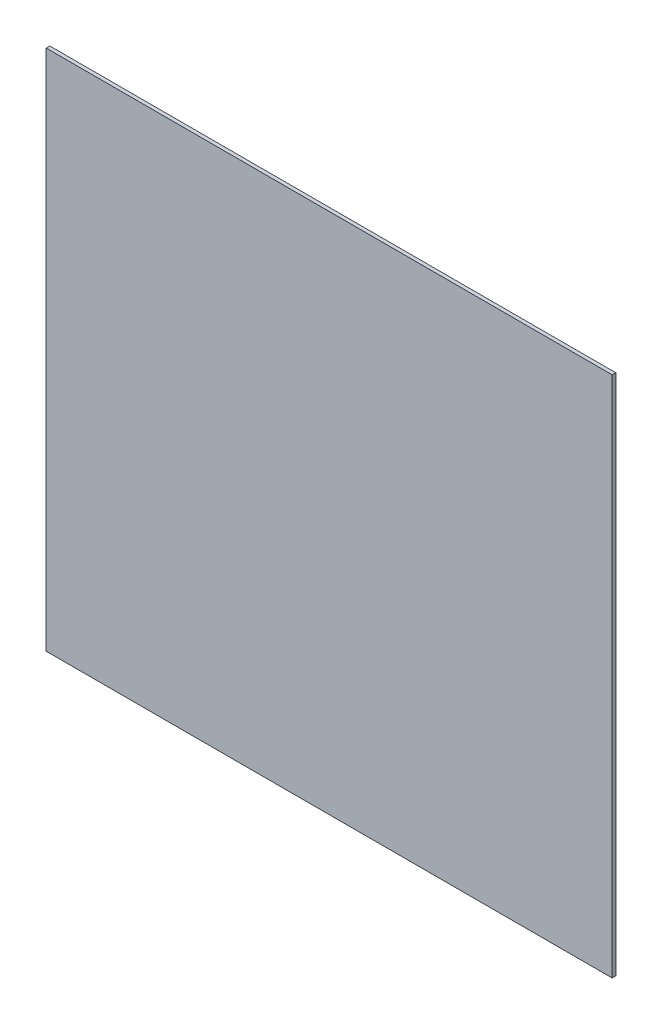
ISO-10303-21;
HEADER;
FILE_DESCRIPTION(('STEP AP214'),'2;1');
FILE_NAME('part.step','',(''),(''),'','','');
FILE_SCHEMA(('AUTOMOTIVE_DESIGN { 1 0 10303 214 1 1 1 1 }'));
ENDSEC;
DATA;
#1=APPLICATION_CONTEXT('core data for automotive mechanical design processes');
#2=APPLICATION_PROTOCOL_DEFINITION('international standard','automotive_design',2000,#1);
#3=PRODUCT_CONTEXT('',#1,'mechanical');
#4=PRODUCT('Part','Part','',(#3));
#5=PRODUCT_RELATED_PRODUCT_CATEGORY('part','',(#4));
#6=PRODUCT_DEFINITION_FORMATION('','',#4);
#7=PRODUCT_DEFINITION_CONTEXT('part definition',#1,'design');
#8=PRODUCT_DEFINITION('design','',#6,#7);
#9=PRODUCT_DEFINITION_SHAPE('','',#8);
#10=(LENGTH_UNIT() NAMED_UNIT(*) SI_UNIT(.MILLI.,.METRE.));
#11=(NAMED_UNIT(*) PLANE_ANGLE_UNIT() SI_UNIT($,.RADIAN.));
#12=(NAMED_UNIT(*) SI_UNIT($,.STERADIAN.) SOLID_ANGLE_UNIT());
#13=UNCERTAINTY_MEASURE_WITH_UNIT(LENGTH_MEASURE(1.E-05),#10,'distance_accuracy_value','');
#14=(GEOMETRIC_REPRESENTATION_CONTEXT(3) GLOBAL_UNCERTAINTY_ASSIGNED_CONTEXT((#13)) GLOBAL_UNIT_ASSIGNED_CONTEXT((#10,
#11,#12)) REPRESENTATION_CONTEXT('',''));
#15=CARTESIAN_POINT('',(0.,0.,0.));
#16=DIRECTION('',(0.,0.,1.));
#17=DIRECTION('',(1.,0.,0.));
#18=AXIS2_PLACEMENT_3D('',#15,#16,#17);
#19=CARTESIAN_POINT('',(456.,312.49200439453,0.41148));
#20=DIRECTION('',(0.,0.,1.));
#21=DIRECTION('',(1.,0.,0.));
#22=AXIS2_PLACEMENT_3D('',#19,#20,#21);
#23=PLANE('',#22);
#24=DIRECTION('',(1.,0.,0.));
#25=VECTOR('',#24,1.);
#26=CARTESIAN_POINT('',(456.,313.,0.41148));
#27=LINE('',#26,#25);
#28=CARTESIAN_POINT('',(456.,313.,0.41148));
#29=VERTEX_POINT('',#28);
#30=CARTESIAN_POINT('',(521.,313.,0.41148));
#31=VERTEX_POINT('',#30);
#32=EDGE_CURVE('E70',#29,#31,#27,.T.);
#33=ORIENTED_EDGE('',*,*,#32,.F.);
#34=DIRECTION('',(0.,1.,0.));
#35=VECTOR('',#34,1.);
#36=CARTESIAN_POINT('',(456.,253.,0.41148));
#37=LINE('',#36,#35);
#38=CARTESIAN_POINT('',(456.,253.,0.41148));
#39=VERTEX_POINT('',#38);
#40=EDGE_CURVE('E20',#39,#29,#37,.T.);
#41=ORIENTED_EDGE('',*,*,#40,.F.);
#42=DIRECTION('',(1.,0.,0.));
#43=VECTOR('',#42,1.);
#44=CARTESIAN_POINT('',(521.,253.,0.41148));
#45=LINE('',#44,#43);
#46=CARTESIAN_POINT('',(521.,253.,0.41148));
#47=VERTEX_POINT('',#46);
#48=EDGE_CURVE('E61',#47,#39,#45,.F.);
#49=ORIENTED_EDGE('',*,*,#48,.F.);
#50=DIRECTION('',(0.,1.,0.));
#51=VECTOR('',#50,1.);
#52=CARTESIAN_POINT('',(521.,313.,0.41148));
#53=LINE('',#52,#51);
#54=EDGE_CURVE('E56',#31,#47,#53,.F.);
#55=ORIENTED_EDGE('',*,*,#54,.F.);
#56=EDGE_LOOP('',(#33,#41,#49,#55));
#57=FACE_BOUND('',#56,.T.);
#58=ADVANCED_FACE('F17',(#57),#23,.T.);
#59=CARTESIAN_POINT('',(521.,253.,0.));
#60=DIRECTION('',(0.,-1.,0.));
#61=DIRECTION('',(0.,0.,-1.));
#62=AXIS2_PLACEMENT_3D('',#59,#60,#61);
#63=PLANE('',#62);
#64=DIRECTION('',(0.,0.,-1.));
#65=VECTOR('',#64,1.);
#66=CARTESIAN_POINT('',(456.,253.,0.));
#67=LINE('',#66,#65);
#68=CARTESIAN_POINT('',(456.,253.,0.));
#69=VERTEX_POINT('',#68);
#70=EDGE_CURVE('E66',#39,#69,#67,.T.);
#71=ORIENTED_EDGE('',*,*,#70,.T.);
#72=DIRECTION('',(1.,0.,0.));
#73=VECTOR('',#72,1.);
#74=CARTESIAN_POINT('',(456.,253.,0.));
#75=LINE('',#74,#73);
#76=CARTESIAN_POINT('',(521.,253.,0.));
#77=VERTEX_POINT('',#76);
#78=EDGE_CURVE('E84',#69,#77,#75,.T.);
#79=ORIENTED_EDGE('',*,*,#78,.T.);
#80=DIRECTION('',(0.,0.,-1.));
#81=VECTOR('',#80,1.);
#82=CARTESIAN_POINT('',(521.,253.,0.));
#83=LINE('',#82,#81);
#84=EDGE_CURVE('E67',#47,#77,#83,.T.);
#85=ORIENTED_EDGE('',*,*,#84,.F.);
#86=ORIENTED_EDGE('',*,*,#48,.T.);
#87=EDGE_LOOP('',(#71,#79,#85,#86));
#88=FACE_BOUND('',#87,.T.);
#89=ADVANCED_FACE('F63',(#88),#63,.T.);
#90=CARTESIAN_POINT('',(521.,313.,0.));
#91=DIRECTION('',(1.,0.,0.));
#92=DIRECTION('',(0.,0.,-1.));
#93=AXIS2_PLACEMENT_3D('',#90,#91,#92);
#94=PLANE('',#93);
#95=ORIENTED_EDGE('',*,*,#84,.T.);
#96=DIRECTION('',(0.,1.,0.));
#97=VECTOR('',#96,1.);
#98=CARTESIAN_POINT('',(521.,312.49200439453,0.));
#99=LINE('',#98,#97);
#100=CARTESIAN_POINT('',(521.,313.,0.));
#101=VERTEX_POINT('',#100);
#102=EDGE_CURVE('E26',#77,#101,#99,.T.);
#103=ORIENTED_EDGE('',*,*,#102,.T.);
#104=DIRECTION('',(0.,0.,1.));
#105=VECTOR('',#104,1.);
#106=CARTESIAN_POINT('',(521.,313.,0.));
#107=LINE('',#106,#105);
#108=EDGE_CURVE('E79',#31,#101,#107,.F.);
#109=ORIENTED_EDGE('',*,*,#108,.F.);
#110=ORIENTED_EDGE('',*,*,#54,.T.);
#111=EDGE_LOOP('',(#95,#103,#109,#110));
#112=FACE_BOUND('',#111,.T.);
#113=ADVANCED_FACE('F88',(#112),#94,.T.);
#114=CARTESIAN_POINT('',(456.,313.,0.));
#115=DIRECTION('',(0.,1.,0.));
#116=DIRECTION('',(0.,0.,1.));
#117=AXIS2_PLACEMENT_3D('',#114,#115,#116);
#118=PLANE('',#117);
#119=ORIENTED_EDGE('',*,*,#108,.T.);
#120=DIRECTION('',(1.,0.,0.));
#121=VECTOR('',#120,1.);
#122=CARTESIAN_POINT('',(456.,313.,0.));
#123=LINE('',#122,#121);
#124=CARTESIAN_POINT('',(456.,313.,0.));
#125=VERTEX_POINT('',#124);
#126=EDGE_CURVE('E11',#101,#125,#123,.F.);
#127=ORIENTED_EDGE('',*,*,#126,.T.);
#128=DIRECTION('',(0.,0.,1.));
#129=VECTOR('',#128,1.);
#130=CARTESIAN_POINT('',(456.,313.,0.));
#131=LINE('',#130,#129);
#132=EDGE_CURVE('E81',#29,#125,#131,.F.);
#133=ORIENTED_EDGE('',*,*,#132,.F.);
#134=ORIENTED_EDGE('',*,*,#32,.T.);
#135=EDGE_LOOP('',(#119,#127,#133,#134));
#136=FACE_BOUND('',#135,.T.);
#137=ADVANCED_FACE('F91',(#136),#118,.T.);
#138=CARTESIAN_POINT('',(456.,312.49200439453,0.));
#139=DIRECTION('',(-1.,0.,0.));
#140=DIRECTION('',(0.,0.,1.));
#141=AXIS2_PLACEMENT_3D('',#138,#139,#140);
#142=PLANE('',#141);
#143=ORIENTED_EDGE('',*,*,#132,.T.);
#144=DIRECTION('',(0.,1.,0.));
#145=VECTOR('',#144,1.);
#146=CARTESIAN_POINT('',(456.,312.49200439453,0.));
#147=LINE('',#146,#145);
#148=EDGE_CURVE('E35',#125,#69,#147,.F.);
#149=ORIENTED_EDGE('',*,*,#148,.T.);
#150=ORIENTED_EDGE('',*,*,#70,.F.);
#151=ORIENTED_EDGE('',*,*,#40,.T.);
#152=EDGE_LOOP('',(#143,#149,#150,#151));
#153=FACE_BOUND('',#152,.T.);
#154=ADVANCED_FACE('F73',(#153),#142,.T.);
#155=CARTESIAN_POINT('',(456.,312.49200439453,0.));
#156=DIRECTION('',(0.,0.,1.));
#157=DIRECTION('',(1.,0.,0.));
#158=AXIS2_PLACEMENT_3D('',#155,#156,#157);
#159=PLANE('',#158);
#160=ORIENTED_EDGE('',*,*,#126,.F.);
#161=ORIENTED_EDGE('',*,*,#102,.F.);
#162=ORIENTED_EDGE('',*,*,#78,.F.);
#163=ORIENTED_EDGE('',*,*,#148,.F.);
#164=EDGE_LOOP('',(#160,#161,#162,#163));
#165=FACE_BOUND('',#164,.T.);
#166=ADVANCED_FACE('F89',(#165),#159,.F.);
#167=CLOSED_SHELL('',(#58,#89,#113,#137,#154,#166));
#168=MANIFOLD_SOLID_BREP('B1',#167);
#169=ADVANCED_BREP_SHAPE_REPRESENTATION('',(#18,#168),#14);
#170=SHAPE_DEFINITION_REPRESENTATION(#9,#169);
ENDSEC;
END-ISO-10303-21;
